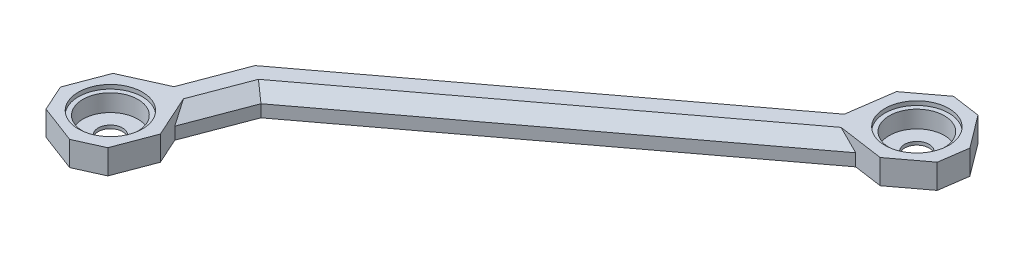
ISO-10303-21;
HEADER;
FILE_DESCRIPTION(('STEP AP214'),'2;1');
FILE_NAME('part.step','',(''),(''),'','','');
FILE_SCHEMA(('AUTOMOTIVE_DESIGN { 1 0 10303 214 1 1 1 1 }'));
ENDSEC;
DATA;
#1=APPLICATION_CONTEXT('core data for automotive mechanical design processes');
#2=APPLICATION_PROTOCOL_DEFINITION('international standard','automotive_design',2000,#1);
#3=PRODUCT_CONTEXT('',#1,'mechanical');
#4=PRODUCT('Part','Part','',(#3));
#5=PRODUCT_RELATED_PRODUCT_CATEGORY('part','',(#4));
#6=PRODUCT_DEFINITION_FORMATION('','',#4);
#7=PRODUCT_DEFINITION_CONTEXT('part definition',#1,'design');
#8=PRODUCT_DEFINITION('design','',#6,#7);
#9=PRODUCT_DEFINITION_SHAPE('','',#8);
#10=(LENGTH_UNIT() NAMED_UNIT(*) SI_UNIT(.MILLI.,.METRE.));
#11=(NAMED_UNIT(*) PLANE_ANGLE_UNIT() SI_UNIT($,.RADIAN.));
#12=(NAMED_UNIT(*) SI_UNIT($,.STERADIAN.) SOLID_ANGLE_UNIT());
#13=UNCERTAINTY_MEASURE_WITH_UNIT(LENGTH_MEASURE(1.E-05),#10,'distance_accuracy_value','');
#14=(GEOMETRIC_REPRESENTATION_CONTEXT(3) GLOBAL_UNCERTAINTY_ASSIGNED_CONTEXT((#13)) GLOBAL_UNIT_ASSIGNED_CONTEXT((#10,
#11,#12)) REPRESENTATION_CONTEXT('',''));
#15=CARTESIAN_POINT('',(0.,0.,0.));
#16=DIRECTION('',(0.,0.,1.));
#17=DIRECTION('',(1.,0.,0.));
#18=AXIS2_PLACEMENT_3D('',#15,#16,#17);
#19=CARTESIAN_POINT('',(129.479734703124,-540.705056381225,54.017746752288));
#20=DIRECTION('',(0.,1.,0.));
#21=DIRECTION('',(0.,0.,-1.));
#22=AXIS2_PLACEMENT_3D('',#19,#20,#21);
#23=CYLINDRICAL_SURFACE('',#22,6.75);
#24=CARTESIAN_POINT('',(129.479734703124,-540.705056381225,54.017746752288));
#25=DIRECTION('',(0.,-1.,0.));
#26=DIRECTION('',(0.,0.,-1.));
#27=AXIS2_PLACEMENT_3D('',#24,#25,#26);
#28=CIRCLE('',#27,6.75);
#29=CARTESIAN_POINT('',(129.479734703124,-540.705056381225,47.267746752288));
#30=VERTEX_POINT('',#29);
#31=EDGE_CURVE('E260',#30,#30,#28,.T.);
#32=ORIENTED_EDGE('',*,*,#31,.T.);
#33=EDGE_LOOP('',(#32));
#34=FACE_BOUND('',#33,.T.);
#35=CARTESIAN_POINT('',(129.479734703124,-536.505056381225,54.017746752288));
#36=DIRECTION('',(0.,-1.,0.));
#37=DIRECTION('',(0.,0.,-1.));
#38=AXIS2_PLACEMENT_3D('',#35,#36,#37);
#39=CIRCLE('',#38,6.75);
#40=CARTESIAN_POINT('',(129.479734703124,-536.505056381225,47.267746752288));
#41=VERTEX_POINT('',#40);
#42=EDGE_CURVE('E257',#41,#41,#39,.F.);
#43=ORIENTED_EDGE('',*,*,#42,.T.);
#44=EDGE_LOOP('',(#43));
#45=FACE_BOUND('',#44,.T.);
#46=ADVANCED_FACE('F41',(#34,#45),#23,.F.);
#47=CARTESIAN_POINT('',(27.0683923401905,-540.705056381225,149.47530428751));
#48=DIRECTION('',(0.,1.,0.));
#49=DIRECTION('',(0.,0.,-1.));
#50=AXIS2_PLACEMENT_3D('',#47,#48,#49);
#51=CYLINDRICAL_SURFACE('',#50,6.75);
#52=CARTESIAN_POINT('',(27.0683923401905,-540.705056381225,149.47530428751));
#53=DIRECTION('',(0.,-1.,0.));
#54=DIRECTION('',(0.,0.,-1.));
#55=AXIS2_PLACEMENT_3D('',#52,#53,#54);
#56=CIRCLE('',#55,6.75);
#57=CARTESIAN_POINT('',(27.0683923401905,-540.705056381225,142.72530428751));
#58=VERTEX_POINT('',#57);
#59=EDGE_CURVE('E212',#58,#58,#56,.T.);
#60=ORIENTED_EDGE('',*,*,#59,.T.);
#61=EDGE_LOOP('',(#60));
#62=FACE_BOUND('',#61,.T.);
#63=CARTESIAN_POINT('',(27.0683923401905,-536.505056381225,149.47530428751));
#64=DIRECTION('',(0.,-1.,0.));
#65=DIRECTION('',(0.,0.,-1.));
#66=AXIS2_PLACEMENT_3D('',#63,#64,#65);
#67=CIRCLE('',#66,6.75);
#68=CARTESIAN_POINT('',(27.0683923401905,-536.505056381225,142.72530428751));
#69=VERTEX_POINT('',#68);
#70=EDGE_CURVE('E254',#69,#69,#67,.F.);
#71=ORIENTED_EDGE('',*,*,#70,.T.);
#72=EDGE_LOOP('',(#71));
#73=FACE_BOUND('',#72,.T.);
#74=ADVANCED_FACE('F518',(#62,#73),#51,.F.);
#75=CARTESIAN_POINT('',(-49.6434018320776,-1083.01019668579,131.125269074854));
#76=DIRECTION('',(-0.354069498432484,0.,0.935219113512854));
#77=DIRECTION('',(0.935219113512854,0.,0.354069498432484));
#78=AXIS2_PLACEMENT_3D('',#75,#76,#77);
#79=PLANE('',#78);
#80=DIRECTION('',(0.,1.,0.));
#81=VECTOR('',#80,1.);
#82=CARTESIAN_POINT('',(28.2037928700447,-541.505098342895,160.59784591198));
#83=LINE('',#82,#81);
#84=CARTESIAN_POINT('',(28.2037928700447,-541.505098342895,160.59784591198));
#85=VERTEX_POINT('',#84);
#86=CARTESIAN_POINT('',(28.2037928700447,-535.505056381225,160.59784591198));
#87=VERTEX_POINT('',#86);
#88=EDGE_CURVE('E236',#85,#87,#83,.T.);
#89=ORIENTED_EDGE('',*,*,#88,.T.);
#90=DIRECTION('',(0.935219113512854,0.,0.354069498432484));
#91=VECTOR('',#90,1.);
#92=CARTESIAN_POINT('',(18.8516024500132,-535.505056381225,157.057151198387));
#93=LINE('',#92,#91);
#94=CARTESIAN_POINT('',(18.8516024500132,-535.505056381225,157.057151198387));
#95=VERTEX_POINT('',#94);
#96=EDGE_CURVE('E251',#95,#87,#93,.T.);
#97=ORIENTED_EDGE('',*,*,#96,.F.);
#98=DIRECTION('',(0.,-1.,0.));
#99=VECTOR('',#98,1.);
#100=CARTESIAN_POINT('',(18.8516024500132,-535.505056381225,157.057151198387));
#101=LINE('',#100,#99);
#102=CARTESIAN_POINT('',(18.8516024500132,-541.505098342895,157.057151198387));
#103=VERTEX_POINT('',#102);
#104=EDGE_CURVE('E242',#95,#103,#101,.T.);
#105=ORIENTED_EDGE('',*,*,#104,.T.);
#106=DIRECTION('',(0.935219113512854,0.,0.354069498432484));
#107=VECTOR('',#106,1.);
#108=CARTESIAN_POINT('',(28.2037928700447,-541.505098342895,160.59784591198));
#109=LINE('',#108,#107);
#110=EDGE_CURVE('E316',#103,#85,#109,.T.);
#111=ORIENTED_EDGE('',*,*,#110,.T.);
#112=EDGE_LOOP('',(#89,#97,#105,#111));
#113=FACE_BOUND('',#112,.T.);
#114=ADVANCED_FACE('F43',(#113),#79,.T.);
#115=CARTESIAN_POINT('',(-43.1708205184204,-1083.01019668579,19.4593086700157));
#116=DIRECTION('',(-0.911664969927574,0.,0.410934280155544));
#117=DIRECTION('',(0.410934280155544,0.,0.911664969927574));
#118=AXIS2_PLACEMENT_3D('',#115,#116,#117);
#119=PLANE('',#118);
#120=ORIENTED_EDGE('',*,*,#104,.F.);
#121=DIRECTION('',(0.410934280155544,0.,0.911664969927574));
#122=VECTOR('',#121,1.);
#123=CARTESIAN_POINT('',(15.9458555281162,-535.505056381225,150.610700249672));
#124=LINE('',#123,#122);
#125=CARTESIAN_POINT('',(15.9458555281162,-535.505056381225,150.610700249672));
#126=VERTEX_POINT('',#125);
#127=EDGE_CURVE('E103',#126,#95,#124,.T.);
#128=ORIENTED_EDGE('',*,*,#127,.F.);
#129=DIRECTION('',(0.,-1.,0.));
#130=VECTOR('',#129,1.);
#131=CARTESIAN_POINT('',(15.9458555281162,-535.505056381225,150.610700249672));
#132=LINE('',#131,#130);
#133=CARTESIAN_POINT('',(15.9458555281162,-541.505098342895,150.610700249672));
#134=VERTEX_POINT('',#133);
#135=EDGE_CURVE('E226',#126,#134,#132,.T.);
#136=ORIENTED_EDGE('',*,*,#135,.T.);
#137=DIRECTION('',(0.410934280155544,0.,0.911664969927574));
#138=VECTOR('',#137,1.);
#139=CARTESIAN_POINT('',(18.8516024500132,-541.505098342895,157.057151198387));
#140=LINE('',#139,#138);
#141=EDGE_CURVE('E314',#134,#103,#140,.T.);
#142=ORIENTED_EDGE('',*,*,#141,.T.);
#143=EDGE_LOOP('',(#120,#128,#136,#142));
#144=FACE_BOUND('',#143,.T.);
#145=ADVANCED_FACE('F497',(#144),#119,.T.);
#146=CARTESIAN_POINT('',(64.9283734286021,-1083.01019668579,144.044116871902));
#147=DIRECTION('',(0.410935769571844,0.,0.911664298569598));
#148=DIRECTION('',(0.911664298569598,0.,-0.410935769571844));
#149=AXIS2_PLACEMENT_3D('',#146,#147,#148);
#150=PLANE('',#149);
#151=DIRECTION('',(0.,1.,0.));
#152=VECTOR('',#151,1.);
#153=CARTESIAN_POINT('',(34.6502363681793,-541.505098342895,157.692089676857));
#154=LINE('',#153,#152);
#155=CARTESIAN_POINT('',(34.6502363681793,-541.505098342895,157.692089676857));
#156=VERTEX_POINT('',#155);
#157=CARTESIAN_POINT('',(34.6502363681793,-535.505056381225,157.692089676857));
#158=VERTEX_POINT('',#157);
#159=EDGE_CURVE('E437',#156,#158,#154,.T.);
#160=ORIENTED_EDGE('',*,*,#159,.T.);
#161=DIRECTION('',(0.911664298569598,0.,-0.410935769571843));
#162=VECTOR('',#161,1.);
#163=CARTESIAN_POINT('',(28.2037928700447,-535.505056381225,160.59784591198));
#164=LINE('',#163,#162);
#165=EDGE_CURVE('E99',#87,#158,#164,.T.);
#166=ORIENTED_EDGE('',*,*,#165,.F.);
#167=ORIENTED_EDGE('',*,*,#88,.F.);
#168=DIRECTION('',(0.911664298569598,0.,-0.410935769571844));
#169=VECTOR('',#168,1.);
#170=CARTESIAN_POINT('',(34.6502363681793,-541.505098342895,157.692089676857));
#171=LINE('',#170,#169);
#172=EDGE_CURVE('E319',#85,#156,#171,.T.);
#173=ORIENTED_EDGE('',*,*,#172,.T.);
#174=EDGE_LOOP('',(#160,#166,#167,#173));
#175=FACE_BOUND('',#174,.T.);
#176=ADVANCED_FACE('F501',(#175),#150,.T.);
#177=CARTESIAN_POINT('',(144.952876856489,-1083.01019668579,20.710121558638));
#178=DIRECTION('',(0.989947038457378,0.,0.141438541598343));
#179=DIRECTION('',(0.141438541598343,0.,-0.989947038457378));
#180=AXIS2_PLACEMENT_3D('',#177,#178,#179);
#181=PLANE('',#180);
#182=DIRECTION('',(0.,1.,0.));
#183=VECTOR('',#182,1.);
#184=CARTESIAN_POINT('',(140.479773283005,-541.505098342895,52.0179644227028));
#185=LINE('',#184,#183);
#186=CARTESIAN_POINT('',(140.479773283005,-541.505098342895,52.0179644227028));
#187=VERTEX_POINT('',#186);
#188=CARTESIAN_POINT('',(140.479773283005,-535.505056381225,52.0179644227028));
#189=VERTEX_POINT('',#188);
#190=EDGE_CURVE('E425',#187,#189,#185,.T.);
#191=ORIENTED_EDGE('',*,*,#190,.T.);
#192=DIRECTION('',(0.141438541598343,0.,-0.989947038457378));
#193=VECTOR('',#192,1.);
#194=CARTESIAN_POINT('',(139.479652047157,-535.505056381225,59.0179450809956));
#195=LINE('',#194,#193);
#196=CARTESIAN_POINT('',(139.479652047157,-535.505056381225,59.0179450809956));
#197=VERTEX_POINT('',#196);
#198=EDGE_CURVE('E228',#197,#189,#195,.T.);
#199=ORIENTED_EDGE('',*,*,#198,.F.);
#200=DIRECTION('',(0.,-1.,0.));
#201=VECTOR('',#200,1.);
#202=CARTESIAN_POINT('',(139.479652047157,-535.505056381225,59.0179450809956));
#203=LINE('',#202,#201);
#204=CARTESIAN_POINT('',(139.479652047157,-541.505098342895,59.0179450809956));
#205=VERTEX_POINT('',#204);
#206=EDGE_CURVE('E222',#197,#205,#203,.T.);
#207=ORIENTED_EDGE('',*,*,#206,.T.);
#208=DIRECTION('',(0.141438541598343,0.,-0.989947038457378));
#209=VECTOR('',#208,1.);
#210=CARTESIAN_POINT('',(140.479773283005,-541.505098342895,52.0179644227028));
#211=LINE('',#210,#209);
#212=EDGE_CURVE('E293',#205,#187,#211,.T.);
#213=ORIENTED_EDGE('',*,*,#212,.T.);
#214=EDGE_LOOP('',(#191,#199,#207,#213));
#215=FACE_BOUND('',#214,.T.);
#216=ADVANCED_FACE('F472',(#215),#181,.T.);
#217=CARTESIAN_POINT('',(63.8189360018059,-1083.01019668579,24.1615655712421));
#218=DIRECTION('',(-0.935219013507438,0.,-0.354069762581013));
#219=DIRECTION('',(-0.354069762581013,0.,0.935219013507438));
#220=AXIS2_PLACEMENT_3D('',#217,#218,#219);
#221=PLANE('',#220);
#222=ORIENTED_EDGE('',*,*,#135,.F.);
#223=DIRECTION('',(-0.354069762581013,0.,0.935219013507438));
#224=VECTOR('',#223,1.);
#225=CARTESIAN_POINT('',(19.4865539669991,-535.505056381225,141.258507966995));
#226=LINE('',#225,#224);
#227=CARTESIAN_POINT('',(19.4865539669991,-535.505056381225,141.258507966995));
#228=VERTEX_POINT('',#227);
#229=EDGE_CURVE('E204',#228,#126,#226,.T.);
#230=ORIENTED_EDGE('',*,*,#229,.F.);
#231=DIRECTION('',(0.,-1.,0.));
#232=VECTOR('',#231,1.);
#233=CARTESIAN_POINT('',(19.4865539669991,-535.505056381225,141.258507966995));
#234=LINE('',#233,#232);
#235=CARTESIAN_POINT('',(19.4865539669991,-541.505098342895,141.258507966995));
#236=VERTEX_POINT('',#235);
#237=EDGE_CURVE('E215',#228,#236,#234,.T.);
#238=ORIENTED_EDGE('',*,*,#237,.T.);
#239=DIRECTION('',(-0.354069762581013,0.,0.935219013507438));
#240=VECTOR('',#239,1.);
#241=CARTESIAN_POINT('',(15.9458555281162,-541.505098342895,150.610700249672));
#242=LINE('',#241,#240);
#243=EDGE_CURVE('E312',#236,#134,#242,.T.);
#244=ORIENTED_EDGE('',*,*,#243,.T.);
#245=EDGE_LOOP('',(#222,#230,#238,#244));
#246=FACE_BOUND('',#245,.T.);
#247=ADVANCED_FACE('F224',(#246),#221,.T.);
#248=CARTESIAN_POINT('',(82.52331484176,-1083.01019668579,31.242960281397));
#249=DIRECTION('',(0.935219013507438,0.,0.354069762581013));
#250=DIRECTION('',(0.354069762581013,0.,-0.935219013507438));
#251=AXIS2_PLACEMENT_3D('',#248,#249,#250);
#252=PLANE('',#251);
#253=DIRECTION('',(0.,-1.,0.));
#254=VECTOR('',#253,1.);
#255=CARTESIAN_POINT('',(38.1909348070621,-535.505056381225,148.33989739418));
#256=LINE('',#255,#254);
#257=CARTESIAN_POINT('',(38.1909348070621,-535.505056381225,148.33989739418));
#258=VERTEX_POINT('',#257);
#259=CARTESIAN_POINT('',(38.1909348070621,-541.505098342895,148.33989739418));
#260=VERTEX_POINT('',#259);
#261=EDGE_CURVE('E430',#258,#260,#256,.T.);
#262=ORIENTED_EDGE('',*,*,#261,.F.);
#263=DIRECTION('',(0.354069762581013,0.,-0.935219013507438));
#264=VECTOR('',#263,1.);
#265=CARTESIAN_POINT('',(34.6502363681793,-535.505056381225,157.692089676857));
#266=LINE('',#265,#264);
#267=EDGE_CURVE('E438',#158,#258,#266,.T.);
#268=ORIENTED_EDGE('',*,*,#267,.F.);
#269=ORIENTED_EDGE('',*,*,#159,.F.);
#270=DIRECTION('',(0.354069762581013,0.,-0.935219013507438));
#271=VECTOR('',#270,1.);
#272=CARTESIAN_POINT('',(38.1909348070621,-541.505098342895,148.33989739418));
#273=LINE('',#272,#271);
#274=EDGE_CURVE('E322',#156,#260,#273,.T.);
#275=ORIENTED_EDGE('',*,*,#274,.T.);
#276=EDGE_LOOP('',(#262,#268,#269,#275));
#277=FACE_BOUND('',#276,.T.);
#278=ADVANCED_FACE('F503',(#277),#252,.T.);
#279=CARTESIAN_POINT('',(64.9414713142655,-1083.01019668579,-48.7040395860676));
#280=DIRECTION('',(0.800012203893529,0.,-0.599983727797195));
#281=DIRECTION('',(-0.599983727797195,0.,-0.800012203893529));
#282=AXIS2_PLACEMENT_3D('',#279,#280,#281);
#283=PLANE('',#282);
#284=DIRECTION('',(0.,1.,0.));
#285=VECTOR('',#284,1.);
#286=CARTESIAN_POINT('',(134.479939937592,-541.505098342895,44.0178476274014));
#287=LINE('',#286,#285);
#288=CARTESIAN_POINT('',(134.479939937592,-541.505098342895,44.0178476274014));
#289=VERTEX_POINT('',#288);
#290=CARTESIAN_POINT('',(134.479939937592,-535.505056381225,44.0178476274014));
#291=VERTEX_POINT('',#290);
#292=EDGE_CURVE('E371',#289,#291,#287,.T.);
#293=ORIENTED_EDGE('',*,*,#292,.T.);
#294=DIRECTION('',(-0.599983727797195,0.,-0.800012203893529));
#295=VECTOR('',#294,1.);
#296=CARTESIAN_POINT('',(140.479773283005,-535.505056381225,52.0179644227028));
#297=LINE('',#296,#295);
#298=EDGE_CURVE('E426',#189,#291,#297,.T.);
#299=ORIENTED_EDGE('',*,*,#298,.F.);
#300=ORIENTED_EDGE('',*,*,#190,.F.);
#301=DIRECTION('',(-0.599983727797195,0.,-0.800012203893529));
#302=VECTOR('',#301,1.);
#303=CARTESIAN_POINT('',(134.479939937592,-541.505098342895,44.0178476274014));
#304=LINE('',#303,#302);
#305=EDGE_CURVE('E296',#187,#289,#304,.T.);
#306=ORIENTED_EDGE('',*,*,#305,.T.);
#307=EDGE_LOOP('',(#293,#299,#300,#306));
#308=FACE_BOUND('',#307,.T.);
#309=ADVANCED_FACE('F476',(#308),#283,.T.);
#310=CARTESIAN_POINT('',(78.5381950830812,-1083.01019668579,104.722079749864));
#311=DIRECTION('',(0.599983549015946,0.,0.800012337973753));
#312=DIRECTION('',(0.800012337973753,0.,-0.599983549015946));
#313=AXIS2_PLACEMENT_3D('',#310,#311,#312);
#314=PLANE('',#313);
#315=ORIENTED_EDGE('',*,*,#206,.F.);
#316=DIRECTION('',(0.800012337973753,0.,-0.599983549015946));
#317=VECTOR('',#316,1.);
#318=CARTESIAN_POINT('',(131.479516625404,-535.505056381225,65.0177896022797));
#319=LINE('',#318,#317);
#320=CARTESIAN_POINT('',(131.479516625404,-535.505056381225,65.0177896022797));
#321=VERTEX_POINT('',#320);
#322=EDGE_CURVE('E416',#321,#197,#319,.T.);
#323=ORIENTED_EDGE('',*,*,#322,.F.);
#324=DIRECTION('',(0.,1.,0.));
#325=VECTOR('',#324,1.);
#326=CARTESIAN_POINT('',(131.479516625404,-541.505098342895,65.0177896022797));
#327=LINE('',#326,#325);
#328=CARTESIAN_POINT('',(131.479516625404,-541.505098342895,65.0177896022797));
#329=VERTEX_POINT('',#328);
#330=EDGE_CURVE('E415',#329,#321,#327,.T.);
#331=ORIENTED_EDGE('',*,*,#330,.F.);
#332=DIRECTION('',(0.800012337973753,0.,-0.599983549015946));
#333=VECTOR('',#332,1.);
#334=CARTESIAN_POINT('',(139.479652047157,-541.505098342895,59.0179450809956));
#335=LINE('',#334,#333);
#336=EDGE_CURVE('E291',#329,#205,#335,.T.);
#337=ORIENTED_EDGE('',*,*,#336,.T.);
#338=EDGE_LOOP('',(#315,#323,#331,#337));
#339=FACE_BOUND('',#338,.T.);
#340=ADVANCED_FACE('F468',(#339),#314,.T.);
#341=CARTESIAN_POINT('',(-6.47342282222166,-1083.01019668579,45.3073530902757));
#342=DIRECTION('',(0.141441565607845,0.,-0.98994660639774));
#343=DIRECTION('',(-0.98994660639774,0.,-0.141441565607845));
#344=AXIS2_PLACEMENT_3D('',#341,#342,#343);
#345=PLANE('',#344);
#346=ORIENTED_EDGE('',*,*,#330,.T.);
#347=DIRECTION('',(0.989946622204622,0.,0.14144145497576));
#348=VECTOR('',#347,1.);
#349=CARTESIAN_POINT('',(120.279543101788,-535.505056381225,63.417561352253));
#350=LINE('',#349,#348);
#351=CARTESIAN_POINT('',(120.279543101788,-535.505056381225,63.417561352253));
#352=VERTEX_POINT('',#351);
#353=EDGE_CURVE('E419',#352,#321,#350,.T.);
#354=ORIENTED_EDGE('',*,*,#353,.F.);
#355=DIRECTION('',(0.808286247231902,-0.577352850059177,0.115486055713726));
#356=VECTOR('',#355,1.);
#357=CARTESIAN_POINT('',(120.279543101788,-535.505056381225,63.417561352253));
#358=LINE('',#357,#356);
#359=CARTESIAN_POINT('',(124.479533558646,-538.505075167305,64.0176477705298));
#360=VERTEX_POINT('',#359);
#361=EDGE_CURVE('E367',#352,#360,#358,.T.);
#362=ORIENTED_EDGE('',*,*,#361,.T.);
#363=DIRECTION('',(0.,1.,0.));
#364=VECTOR('',#363,1.);
#365=CARTESIAN_POINT('',(124.479532241821,-541.505098342895,64.0176460146904));
#366=LINE('',#365,#364);
#367=CARTESIAN_POINT('',(124.479532241821,-541.505098342895,64.0176460146904));
#368=VERTEX_POINT('',#367);
#369=EDGE_CURVE('E335',#368,#360,#366,.T.);
#370=ORIENTED_EDGE('',*,*,#369,.F.);
#371=DIRECTION('',(0.98994660639774,0.,0.141441565607845));
#372=VECTOR('',#371,1.);
#373=CARTESIAN_POINT('',(131.479516625404,-541.505098342895,65.0177896022797));
#374=LINE('',#373,#372);
#375=EDGE_CURVE('E333',#368,#329,#374,.T.);
#376=ORIENTED_EDGE('',*,*,#375,.T.);
#377=EDGE_LOOP('',(#346,#354,#362,#370,#376));
#378=FACE_BOUND('',#377,.T.);
#379=ADVANCED_FACE('F463',(#378),#345,.F.);
#380=CARTESIAN_POINT('',(-23.8316201354801,-1083.01019668579,10.7421683441062));
#381=DIRECTION('',(0.9116645153807,0.,-0.410935288574337));
#382=DIRECTION('',(-0.410935288574337,0.,-0.9116645153807));
#383=AXIS2_PLACEMENT_3D('',#380,#381,#382);
#384=PLANE('',#383);
#385=DIRECTION('',(-0.335526570667552,0.577354362423804,-0.74436809480678));
#386=VECTOR('',#385,1.);
#387=CARTESIAN_POINT('',(35.2851860225201,-538.50507736206,141.893461346626));
#388=LINE('',#387,#386);
#389=CARTESIAN_POINT('',(35.2851912753888,-538.505071745369,141.893463335336));
#390=VERTEX_POINT('',#389);
#391=CARTESIAN_POINT('',(33.5417389869689,-535.505056381225,138.025611639023));
#392=VERTEX_POINT('',#391);
#393=EDGE_CURVE('E399',#390,#392,#388,.T.);
#394=ORIENTED_EDGE('',*,*,#393,.T.);
#395=DIRECTION('',(-0.410935519115743,0.,-0.911664411463492));
#396=VECTOR('',#395,1.);
#397=CARTESIAN_POINT('',(38.1909348070621,-535.505056381225,148.33989739418));
#398=LINE('',#397,#396);
#399=EDGE_CURVE('E233',#258,#392,#398,.T.);
#400=ORIENTED_EDGE('',*,*,#399,.F.);
#401=ORIENTED_EDGE('',*,*,#261,.T.);
#402=DIRECTION('',(-0.410935288574337,0.,-0.9116645153807));
#403=VECTOR('',#402,1.);
#404=CARTESIAN_POINT('',(35.2851860225201,-541.505098342895,141.893461346626));
#405=LINE('',#404,#403);
#406=CARTESIAN_POINT('',(35.2851860225201,-541.505098342895,141.893461346626));
#407=VERTEX_POINT('',#406);
#408=EDGE_CURVE('E325',#260,#407,#405,.T.);
#409=ORIENTED_EDGE('',*,*,#408,.T.);
#410=DIRECTION('',(0.,1.,0.));
#411=VECTOR('',#410,1.);
#412=CARTESIAN_POINT('',(35.2851860225201,-541.505098342895,141.893461346626));
#413=LINE('',#412,#411);
#414=EDGE_CURVE('E341',#407,#390,#413,.T.);
#415=ORIENTED_EDGE('',*,*,#414,.T.);
#416=EDGE_LOOP('',(#394,#400,#401,#409,#415));
#417=FACE_BOUND('',#416,.T.);
#418=ADVANCED_FACE('F449',(#417),#384,.T.);
#419=CARTESIAN_POINT('',(-220.367994295224,-847.379551908985,-83.4303256463113));
#420=DIRECTION('',(-0.661302318628494,0.707104006773664,-0.250366065953852));
#421=DIRECTION('',(0.730365230114586,0.683056828265166,0.));
#422=AXIS2_PLACEMENT_3D('',#419,#420,#421);
#423=PLANE('',#422);
#424=DIRECTION('',(-0.354069696803158,0.,0.935219038410639));
#425=VECTOR('',#424,1.);
#426=CARTESIAN_POINT('',(35.2654047310352,-535.505056381225,122.175596654415));
#427=LINE('',#426,#425);
#428=CARTESIAN_POINT('',(35.2654047310352,-535.505056381225,122.175596654415));
#429=VERTEX_POINT('',#428);
#430=CARTESIAN_POINT('',(29.8008661066296,-535.505056381225,136.60932068657));
#431=VERTEX_POINT('',#430);
#432=EDGE_CURVE('E207',#429,#431,#427,.T.);
#433=ORIENTED_EDGE('',*,*,#432,.F.);
#434=DIRECTION('',(0.57653598835794,0.692649616680754,0.433408309380586));
#435=VECTOR('',#434,1.);
#436=CARTESIAN_POINT('',(32.7682979404926,-538.50507736206,120.298407971859));
#437=LINE('',#436,#435);
#438=CARTESIAN_POINT('',(32.7682979404926,-538.50507736206,120.298407971859));
#439=VERTEX_POINT('',#438);
#440=EDGE_CURVE('E379',#439,#429,#437,.T.);
#441=ORIENTED_EDGE('',*,*,#440,.F.);
#442=DIRECTION('',(0.354069785973779,0.,-0.93521900465104));
#443=VECTOR('',#442,1.);
#444=CARTESIAN_POINT('',(25.9329974651337,-538.50507736206,138.352766633034));
#445=LINE('',#444,#443);
#446=CARTESIAN_POINT('',(25.9329974651337,-538.50507736206,138.352766633034));
#447=VERTEX_POINT('',#446);
#448=EDGE_CURVE('E389',#447,#439,#445,.T.);
#449=ORIENTED_EDGE('',*,*,#448,.F.);
#450=DIRECTION('',(-0.744369354357326,-0.577352837040572,0.33552640112942));
#451=VECTOR('',#450,1.);
#452=CARTESIAN_POINT('',(29.8008639365435,-535.505056381225,136.609315872192));
#453=LINE('',#452,#451);
#454=EDGE_CURVE('E388',#431,#447,#453,.T.);
#455=ORIENTED_EDGE('',*,*,#454,.F.);
#456=EDGE_LOOP('',(#433,#441,#449,#455));
#457=FACE_BOUND('',#456,.T.);
#458=ADVANCED_FACE('F489',(#457),#423,.T.);
#459=CARTESIAN_POINT('',(-3.47299137580907,-1083.01019668579,24.3074856941509));
#460=DIRECTION('',(0.141441049312258,0.,-0.98994668016487));
#461=DIRECTION('',(-0.98994668016487,0.,-0.141441049312258));
#462=AXIS2_PLACEMENT_3D('',#459,#460,#461);
#463=PLANE('',#462);
#464=DIRECTION('',(0.,1.,0.));
#465=VECTOR('',#464,1.);
#466=CARTESIAN_POINT('',(127.479955554008,-541.505098342895,43.0177077651024));
#467=LINE('',#466,#465);
#468=CARTESIAN_POINT('',(127.479955554008,-541.505098342895,43.0177077651024));
#469=VERTEX_POINT('',#468);
#470=CARTESIAN_POINT('',(127.479955554008,-535.505056381225,43.0177077651024));
#471=VERTEX_POINT('',#470);
#472=EDGE_CURVE('E351',#469,#471,#467,.T.);
#473=ORIENTED_EDGE('',*,*,#472,.T.);
#474=DIRECTION('',(-0.98994668016487,0.,-0.141441049312258));
#475=VECTOR('',#474,1.);
#476=CARTESIAN_POINT('',(134.479939937592,-535.505056381225,44.0178476274014));
#477=LINE('',#476,#475);
#478=EDGE_CURVE('E372',#291,#471,#477,.T.);
#479=ORIENTED_EDGE('',*,*,#478,.F.);
#480=ORIENTED_EDGE('',*,*,#292,.F.);
#481=DIRECTION('',(-0.98994668016487,0.,-0.141441049312258));
#482=VECTOR('',#481,1.);
#483=CARTESIAN_POINT('',(127.479955554008,-541.505098342895,43.0177077651024));
#484=LINE('',#483,#482);
#485=EDGE_CURVE('E299',#289,#469,#484,.T.);
#486=ORIENTED_EDGE('',*,*,#485,.T.);
#487=EDGE_LOOP('',(#473,#479,#480,#486));
#488=FACE_BOUND('',#487,.T.);
#489=ADVANCED_FACE('F478',(#488),#463,.T.);
#490=CARTESIAN_POINT('',(-128.577661431331,-868.710099412362,-171.443993125453));
#491=DIRECTION('',(0.424254482814095,-0.707103986210737,0.565696107903378));
#492=DIRECTION('',(0.,0.624703746604736,0.780861850123315));
#493=AXIS2_PLACEMENT_3D('',#490,#491,#492);
#494=PLANE('',#493);
#495=DIRECTION('',(0.115486122636213,-0.577353184626739,-0.808285998690944));
#496=VECTOR('',#495,1.);
#497=CARTESIAN_POINT('',(117.87960678339,-535.505056381225,60.2175146341324));
#498=LINE('',#497,#496);
#499=CARTESIAN_POINT('',(117.87960678339,-535.505056381225,60.2175146341324));
#500=VERTEX_POINT('',#499);
#501=CARTESIAN_POINT('',(118.479691445827,-538.50507736206,56.017529219389));
#502=VERTEX_POINT('',#501);
#503=EDGE_CURVE('E358',#500,#502,#498,.T.);
#504=ORIENTED_EDGE('',*,*,#503,.T.);
#505=DIRECTION('',(-0.800011945789754,0.,0.599984071949991));
#506=VECTOR('',#505,1.);
#507=CARTESIAN_POINT('',(118.479691445827,-538.50507736206,56.017529219389));
#508=LINE('',#507,#506);
#509=EDGE_CURVE('E11',#502,#439,#508,.T.);
#510=ORIENTED_EDGE('',*,*,#509,.T.);
#511=ORIENTED_EDGE('',*,*,#440,.T.);
#512=DIRECTION('',(-0.80001194342984,0.,0.599984075096674));
#513=VECTOR('',#512,1.);
#514=CARTESIAN_POINT('',(117.87960678339,-535.505056381225,60.2175146341324));
#515=LINE('',#514,#513);
#516=EDGE_CURVE('E383',#500,#429,#515,.T.);
#517=ORIENTED_EDGE('',*,*,#516,.F.);
#518=EDGE_LOOP('',(#504,#510,#511,#517));
#519=FACE_BOUND('',#518,.T.);
#520=ADVANCED_FACE('F485',(#519),#494,.F.);
#521=CARTESIAN_POINT('',(66.5385995716973,-1083.01019668579,88.7218234524504));
#522=DIRECTION('',(-0.599984025837021,0.,-0.800011980373045));
#523=DIRECTION('',(-0.800011980373045,0.,0.599984025837021));
#524=AXIS2_PLACEMENT_3D('',#521,#522,#523);
#525=PLANE('',#524);
#526=DIRECTION('',(0.,-1.,0.));
#527=VECTOR('',#526,1.);
#528=CARTESIAN_POINT('',(119.479835033417,-535.505056381225,49.0175485610962));
#529=LINE('',#528,#527);
#530=CARTESIAN_POINT('',(119.479835033417,-535.505056381225,49.0175485610962));
#531=VERTEX_POINT('',#530);
#532=CARTESIAN_POINT('',(119.479835033417,-541.505098342895,49.0175485610962));
#533=VERTEX_POINT('',#532);
#534=EDGE_CURVE('E52',#531,#533,#529,.T.);
#535=ORIENTED_EDGE('',*,*,#534,.F.);
#536=DIRECTION('',(-0.800011980373045,0.,0.599984025837021));
#537=VECTOR('',#536,1.);
#538=CARTESIAN_POINT('',(127.479955554008,-535.505056381225,43.0177077651024));
#539=LINE('',#538,#537);
#540=EDGE_CURVE('E352',#471,#531,#539,.T.);
#541=ORIENTED_EDGE('',*,*,#540,.F.);
#542=ORIENTED_EDGE('',*,*,#472,.F.);
#543=DIRECTION('',(-0.800011980373045,0.,0.599984025837021));
#544=VECTOR('',#543,1.);
#545=CARTESIAN_POINT('',(119.479835033417,-541.505098342895,49.0175485610962));
#546=LINE('',#545,#544);
#547=EDGE_CURVE('E302',#469,#533,#546,.T.);
#548=ORIENTED_EDGE('',*,*,#547,.T.);
#549=EDGE_LOOP('',(#535,#541,#542,#548));
#550=FACE_BOUND('',#549,.T.);
#551=ADVANCED_FACE('F482',(#550),#525,.T.);
#552=CARTESIAN_POINT('',(123.952973780132,-1083.01019668579,17.7101592047906));
#553=DIRECTION('',(-0.989946595858015,0.,-0.141441639375142));
#554=DIRECTION('',(-0.141441639375142,0.,0.989946595858015));
#555=AXIS2_PLACEMENT_3D('',#552,#553,#554);
#556=PLANE('',#555);
#557=ORIENTED_EDGE('',*,*,#503,.F.);
#558=DIRECTION('',(-0.141441547184836,0.,0.989946609029982));
#559=VECTOR('',#558,1.);
#560=CARTESIAN_POINT('',(119.479835033417,-535.505056381225,49.0175485610962));
#561=LINE('',#560,#559);
#562=EDGE_CURVE('E61',#531,#500,#561,.T.);
#563=ORIENTED_EDGE('',*,*,#562,.F.);
#564=ORIENTED_EDGE('',*,*,#534,.T.);
#565=DIRECTION('',(-0.141441639375142,0.,0.989946595858015));
#566=VECTOR('',#565,1.);
#567=CARTESIAN_POINT('',(118.479691445827,-541.505098342895,56.017529219389));
#568=LINE('',#567,#566);
#569=CARTESIAN_POINT('',(118.479691445827,-541.505098342895,56.017529219389));
#570=VERTEX_POINT('',#569);
#571=EDGE_CURVE('E305',#533,#570,#568,.T.);
#572=ORIENTED_EDGE('',*,*,#571,.T.);
#573=DIRECTION('',(0.,1.,0.));
#574=VECTOR('',#573,1.);
#575=CARTESIAN_POINT('',(118.479691445827,-541.505098342895,56.017529219389));
#576=LINE('',#575,#574);
#577=EDGE_CURVE('E118',#570,#502,#576,.T.);
#578=ORIENTED_EDGE('',*,*,#577,.T.);
#579=EDGE_LOOP('',(#557,#563,#564,#572,#578));
#580=FACE_BOUND('',#579,.T.);
#581=ADVANCED_FACE('F483',(#580),#556,.T.);
#582=CARTESIAN_POINT('',(0.,-535.505056381225,0.));
#583=DIRECTION('',(0.,1.,0.));
#584=DIRECTION('',(0.,0.,-1.));
#585=AXIS2_PLACEMENT_3D('',#582,#583,#584);
#586=PLANE('',#585);
#587=CARTESIAN_POINT('',(27.0683923401905,-535.505056381225,149.47530428751));
#588=DIRECTION('',(0.,-1.,0.));
#589=DIRECTION('',(0.,0.,-1.));
#590=AXIS2_PLACEMENT_3D('',#587,#588,#589);
#591=CIRCLE('',#590,7.84999999999999);
#592=CARTESIAN_POINT('',(27.0683923401905,-535.505056381225,141.62530428751));
#593=VERTEX_POINT('',#592);
#594=EDGE_CURVE('E278',#593,#593,#591,.T.);
#595=ORIENTED_EDGE('',*,*,#594,.T.);
#596=EDGE_LOOP('',(#595));
#597=FACE_BOUND('',#596,.T.);
#598=CARTESIAN_POINT('',(129.479734703124,-535.505056381225,54.017746752288));
#599=DIRECTION('',(0.,-1.,0.));
#600=DIRECTION('',(0.,0.,-1.));
#601=AXIS2_PLACEMENT_3D('',#598,#599,#600);
#602=CIRCLE('',#601,7.84999999999999);
#603=CARTESIAN_POINT('',(129.479734703124,-535.505056381225,46.167746752288));
#604=VERTEX_POINT('',#603);
#605=EDGE_CURVE('E267',#604,#604,#602,.T.);
#606=ORIENTED_EDGE('',*,*,#605,.T.);
#607=EDGE_LOOP('',(#606));
#608=FACE_BOUND('',#607,.T.);
#609=DIRECTION('',(-0.911665088053401,0.,0.410934018091208));
#610=VECTOR('',#609,1.);
#611=CARTESIAN_POINT('',(29.8008661066296,-535.505056381225,136.60932068657));
#612=LINE('',#611,#610);
#613=EDGE_CURVE('E200',#431,#228,#612,.T.);
#614=ORIENTED_EDGE('',*,*,#613,.T.);
#615=ORIENTED_EDGE('',*,*,#229,.T.);
#616=ORIENTED_EDGE('',*,*,#127,.T.);
#617=ORIENTED_EDGE('',*,*,#96,.T.);
#618=ORIENTED_EDGE('',*,*,#165,.T.);
#619=ORIENTED_EDGE('',*,*,#267,.T.);
#620=ORIENTED_EDGE('',*,*,#399,.T.);
#621=DIRECTION('',(0.354069298900997,0.,-0.9352191890545));
#622=VECTOR('',#621,1.);
#623=CARTESIAN_POINT('',(33.541738986969,-535.505056381225,138.025611639023));
#624=LINE('',#623,#622);
#625=CARTESIAN_POINT('',(38.5948829352857,-535.505056381225,124.678514897823));
#626=VERTEX_POINT('',#625);
#627=EDGE_CURVE('E403',#392,#626,#624,.T.);
#628=ORIENTED_EDGE('',*,*,#627,.T.);
#629=DIRECTION('',(0.800011947996977,0.,-0.599984069006904));
#630=VECTOR('',#629,1.);
#631=CARTESIAN_POINT('',(38.5948829352856,-535.505056381225,124.678514897823));
#632=LINE('',#631,#630);
#633=EDGE_CURVE('E221',#626,#352,#632,.T.);
#634=ORIENTED_EDGE('',*,*,#633,.T.);
#635=ORIENTED_EDGE('',*,*,#353,.T.);
#636=ORIENTED_EDGE('',*,*,#322,.T.);
#637=ORIENTED_EDGE('',*,*,#198,.T.);
#638=ORIENTED_EDGE('',*,*,#298,.T.);
#639=ORIENTED_EDGE('',*,*,#478,.T.);
#640=ORIENTED_EDGE('',*,*,#540,.T.);
#641=ORIENTED_EDGE('',*,*,#562,.T.);
#642=ORIENTED_EDGE('',*,*,#516,.T.);
#643=ORIENTED_EDGE('',*,*,#432,.T.);
#644=EDGE_LOOP('',(#614,#615,#616,#617,#618,#619,#620,#628,#634,#635,#636,#637,#638,#639,#640,
#641,#642,#643));
#645=FACE_BOUND('',#644,.T.);
#646=ADVANCED_FACE('F202',(#597,#608,#645),#586,.T.);
#647=CARTESIAN_POINT('',(32.7682979404926,-541.505098342895,120.298407971859));
#648=DIRECTION('',(0.599984071949991,0.,0.800011945789754));
#649=DIRECTION('',(0.800011945789754,0.,-0.599984071949991));
#650=AXIS2_PLACEMENT_3D('',#647,#648,#649);
#651=PLANE('',#650);
#652=ORIENTED_EDGE('',*,*,#509,.F.);
#653=ORIENTED_EDGE('',*,*,#577,.F.);
#654=DIRECTION('',(-0.800011945789754,0.,0.599984071949991));
#655=VECTOR('',#654,1.);
#656=CARTESIAN_POINT('',(32.7682979404926,-541.505098342895,120.298407971859));
#657=LINE('',#656,#655);
#658=CARTESIAN_POINT('',(32.7682979404926,-541.505098342895,120.298407971859));
#659=VERTEX_POINT('',#658);
#660=EDGE_CURVE('E307',#570,#659,#657,.T.);
#661=ORIENTED_EDGE('',*,*,#660,.T.);
#662=DIRECTION('',(0.,1.,0.));
#663=VECTOR('',#662,1.);
#664=CARTESIAN_POINT('',(32.7682979404926,-541.505098342895,120.298407971859));
#665=LINE('',#664,#663);
#666=EDGE_CURVE('E111',#659,#439,#665,.T.);
#667=ORIENTED_EDGE('',*,*,#666,.T.);
#668=EDGE_LOOP('',(#652,#653,#661,#667));
#669=FACE_BOUND('',#668,.T.);
#670=ADVANCED_FACE('F656',(#669),#651,.F.);
#671=CARTESIAN_POINT('',(25.9329974651337,-541.505098342895,138.352766633034));
#672=DIRECTION('',(0.93521900465104,0.,0.354069785973779));
#673=DIRECTION('',(0.354069785973779,0.,-0.93521900465104));
#674=AXIS2_PLACEMENT_3D('',#671,#672,#673);
#675=PLANE('',#674);
#676=ORIENTED_EDGE('',*,*,#448,.T.);
#677=ORIENTED_EDGE('',*,*,#666,.F.);
#678=DIRECTION('',(-0.354069785973779,0.,0.93521900465104));
#679=VECTOR('',#678,1.);
#680=CARTESIAN_POINT('',(25.9329974651337,-541.505098342895,138.352766633034));
#681=LINE('',#680,#679);
#682=CARTESIAN_POINT('',(25.9329974651337,-541.505098342895,138.352766633034));
#683=VERTEX_POINT('',#682);
#684=EDGE_CURVE('E309',#659,#683,#681,.T.);
#685=ORIENTED_EDGE('',*,*,#684,.T.);
#686=DIRECTION('',(0.,1.,0.));
#687=VECTOR('',#686,1.);
#688=CARTESIAN_POINT('',(25.9329974651337,-541.505098342895,138.352766633034));
#689=LINE('',#688,#687);
#690=EDGE_CURVE('E344',#683,#447,#689,.T.);
#691=ORIENTED_EDGE('',*,*,#690,.T.);
#692=EDGE_LOOP('',(#676,#677,#685,#691));
#693=FACE_BOUND('',#692,.T.);
#694=ADVANCED_FACE('F491',(#693),#675,.F.);
#695=CARTESIAN_POINT('',(41.0919934511185,-541.505098342895,126.55571103096));
#696=DIRECTION('',(-0.935218946532656,0.,-0.354069939484206));
#697=DIRECTION('',(-0.354069939484206,0.,0.935218946532656));
#698=AXIS2_PLACEMENT_3D('',#695,#696,#697);
#699=PLANE('',#698);
#700=DIRECTION('',(0.354069939484206,0.,-0.935218946532656));
#701=VECTOR('',#700,1.);
#702=CARTESIAN_POINT('',(35.2851860225201,-538.50507736206,141.893461346626));
#703=LINE('',#702,#701);
#704=CARTESIAN_POINT('',(41.0919934511184,-538.50507736206,126.55571103096));
#705=VERTEX_POINT('',#704);
#706=EDGE_CURVE('E393',#390,#705,#703,.T.);
#707=ORIENTED_EDGE('',*,*,#706,.F.);
#708=ORIENTED_EDGE('',*,*,#414,.F.);
#709=DIRECTION('',(0.354069939484206,0.,-0.935218946532656));
#710=VECTOR('',#709,1.);
#711=CARTESIAN_POINT('',(41.0919934511185,-541.505098342895,126.55571103096));
#712=LINE('',#711,#710);
#713=CARTESIAN_POINT('',(41.0919934511185,-541.505098342895,126.55571103096));
#714=VERTEX_POINT('',#713);
#715=EDGE_CURVE('E328',#407,#714,#712,.T.);
#716=ORIENTED_EDGE('',*,*,#715,.T.);
#717=DIRECTION('',(0.,1.,0.));
#718=VECTOR('',#717,1.);
#719=CARTESIAN_POINT('',(41.0919934511185,-541.505098342895,126.55571103096));
#720=LINE('',#719,#718);
#721=EDGE_CURVE('E338',#714,#705,#720,.T.);
#722=ORIENTED_EDGE('',*,*,#721,.T.);
#723=EDGE_LOOP('',(#707,#708,#716,#722));
#724=FACE_BOUND('',#723,.T.);
#725=ADVANCED_FACE('F506',(#724),#699,.F.);
#726=CARTESIAN_POINT('',(124.479532241821,-541.505098342895,64.0176460146904));
#727=DIRECTION('',(-0.599984102697436,0.,-0.800011922730125));
#728=DIRECTION('',(-0.800011922730125,0.,0.599984102697436));
#729=AXIS2_PLACEMENT_3D('',#726,#727,#728);
#730=PLANE('',#729);
#731=DIRECTION('',(0.800011922730125,0.,-0.599984102697436));
#732=VECTOR('',#731,1.);
#733=CARTESIAN_POINT('',(41.0919934511185,-538.50507736206,126.55571103096));
#734=LINE('',#733,#732);
#735=EDGE_CURVE('E362',#705,#360,#734,.T.);
#736=ORIENTED_EDGE('',*,*,#735,.F.);
#737=ORIENTED_EDGE('',*,*,#721,.F.);
#738=DIRECTION('',(0.800011922730125,0.,-0.599984102697436));
#739=VECTOR('',#738,1.);
#740=CARTESIAN_POINT('',(124.479532241821,-541.505098342895,64.0176460146904));
#741=LINE('',#740,#739);
#742=EDGE_CURVE('E331',#714,#368,#741,.T.);
#743=ORIENTED_EDGE('',*,*,#742,.T.);
#744=ORIENTED_EDGE('',*,*,#369,.T.);
#745=EDGE_LOOP('',(#736,#737,#743,#744));
#746=FACE_BOUND('',#745,.T.);
#747=ADVANCED_FACE('F508',(#746),#730,.F.);
#748=CARTESIAN_POINT('',(0.,-541.505098342895,0.));
#749=DIRECTION('',(0.,-1.,0.));
#750=DIRECTION('',(0.,0.,1.));
#751=AXIS2_PLACEMENT_3D('',#748,#749,#750);
#752=PLANE('',#751);
#753=CARTESIAN_POINT('',(27.0683923401905,-541.505098342895,149.47530428751));
#754=DIRECTION('',(0.,1.,0.));
#755=DIRECTION('',(0.,0.,1.));
#756=AXIS2_PLACEMENT_3D('',#753,#754,#755);
#757=CIRCLE('',#756,3.);
#758=CARTESIAN_POINT('',(27.0683923401905,-541.505098342895,152.47530428751));
#759=VERTEX_POINT('',#758);
#760=EDGE_CURVE('E263',#759,#759,#757,.T.);
#761=ORIENTED_EDGE('',*,*,#760,.T.);
#762=EDGE_LOOP('',(#761));
#763=FACE_BOUND('',#762,.T.);
#764=CARTESIAN_POINT('',(129.479734703124,-541.505098342895,54.017746752288));
#765=DIRECTION('',(0.,1.,0.));
#766=DIRECTION('',(0.,0.,1.));
#767=AXIS2_PLACEMENT_3D('',#764,#765,#766);
#768=CIRCLE('',#767,2.99999999999999);
#769=CARTESIAN_POINT('',(129.479734703124,-541.505098342895,57.017746752288));
#770=VERTEX_POINT('',#769);
#771=EDGE_CURVE('E269',#770,#770,#768,.T.);
#772=ORIENTED_EDGE('',*,*,#771,.T.);
#773=EDGE_LOOP('',(#772));
#774=FACE_BOUND('',#773,.T.);
#775=ORIENTED_EDGE('',*,*,#684,.F.);
#776=ORIENTED_EDGE('',*,*,#660,.F.);
#777=ORIENTED_EDGE('',*,*,#571,.F.);
#778=ORIENTED_EDGE('',*,*,#547,.F.);
#779=ORIENTED_EDGE('',*,*,#485,.F.);
#780=ORIENTED_EDGE('',*,*,#305,.F.);
#781=ORIENTED_EDGE('',*,*,#212,.F.);
#782=ORIENTED_EDGE('',*,*,#336,.F.);
#783=ORIENTED_EDGE('',*,*,#375,.F.);
#784=ORIENTED_EDGE('',*,*,#742,.F.);
#785=ORIENTED_EDGE('',*,*,#715,.F.);
#786=ORIENTED_EDGE('',*,*,#408,.F.);
#787=ORIENTED_EDGE('',*,*,#274,.F.);
#788=ORIENTED_EDGE('',*,*,#172,.F.);
#789=ORIENTED_EDGE('',*,*,#110,.F.);
#790=ORIENTED_EDGE('',*,*,#141,.F.);
#791=ORIENTED_EDGE('',*,*,#243,.F.);
#792=DIRECTION('',(0.9116650880534,0.,-0.410934018091209));
#793=VECTOR('',#792,1.);
#794=CARTESIAN_POINT('',(19.4865539669991,-541.505098342895,141.258507966995));
#795=LINE('',#794,#793);
#796=EDGE_CURVE('E211',#236,#683,#795,.T.);
#797=ORIENTED_EDGE('',*,*,#796,.T.);
#798=EDGE_LOOP('',(#775,#776,#777,#778,#779,#780,#781,#782,#783,#784,#785,#786,#787,#788,#789,
#790,#791,#797));
#799=FACE_BOUND('',#798,.T.);
#800=ADVANCED_FACE('F493',(#763,#774,#799),#752,.T.);
#801=CARTESIAN_POINT('',(201.116572709247,-747.808697775241,268.166555445239));
#802=DIRECTION('',(-0.424253872735841,-0.70710499957282,-0.565695298767599));
#803=DIRECTION('',(0.,-0.624702655886392,0.780862722716668));
#804=AXIS2_PLACEMENT_3D('',#801,#802,#803);
#805=PLANE('',#804);
#806=DIRECTION('',(0.576536132729623,-0.692648756805788,0.43340949153493));
#807=VECTOR('',#806,1.);
#808=CARTESIAN_POINT('',(38.5948829352856,-535.505056381225,124.678514897823));
#809=LINE('',#808,#807);
#810=EDGE_CURVE('E404',#626,#705,#809,.T.);
#811=ORIENTED_EDGE('',*,*,#810,.T.);
#812=ORIENTED_EDGE('',*,*,#735,.T.);
#813=ORIENTED_EDGE('',*,*,#361,.F.);
#814=ORIENTED_EDGE('',*,*,#633,.F.);
#815=EDGE_LOOP('',(#811,#812,#813,#814));
#816=FACE_BOUND('',#815,.T.);
#817=ADVANCED_FACE('F457',(#816),#805,.F.);
#818=CARTESIAN_POINT('',(293.539643650332,-769.139495184975,111.132638255638));
#819=DIRECTION('',(-0.661301791272194,-0.707104684563838,-0.2503655446104));
#820=DIRECTION('',(-0.730365828494173,0.683056188441347,0.));
#821=AXIS2_PLACEMENT_3D('',#818,#819,#820);
#822=PLANE('',#821);
#823=ORIENTED_EDGE('',*,*,#706,.T.);
#824=ORIENTED_EDGE('',*,*,#810,.F.);
#825=ORIENTED_EDGE('',*,*,#627,.F.);
#826=ORIENTED_EDGE('',*,*,#393,.F.);
#827=EDGE_LOOP('',(#823,#824,#825,#826));
#828=FACE_BOUND('',#827,.T.);
#829=ADVANCED_FACE('F452',(#828),#822,.F.);
#830=CARTESIAN_POINT('',(56.2108991855948,-1083.01019668579,124.704969896705));
#831=DIRECTION('',(0.410934018091206,0.,0.911665088053401));
#832=DIRECTION('',(0.911665088053402,0.,-0.410934018091206));
#833=AXIS2_PLACEMENT_3D('',#830,#831,#832);
#834=PLANE('',#833);
#835=ORIENTED_EDGE('',*,*,#454,.T.);
#836=ORIENTED_EDGE('',*,*,#690,.F.);
#837=ORIENTED_EDGE('',*,*,#796,.F.);
#838=ORIENTED_EDGE('',*,*,#237,.F.);
#839=ORIENTED_EDGE('',*,*,#613,.F.);
#840=EDGE_LOOP('',(#835,#836,#837,#838,#839));
#841=FACE_BOUND('',#840,.T.);
#842=ADVANCED_FACE('F216',(#841),#834,.F.);
#843=CARTESIAN_POINT('',(129.479734703124,-540.705056381225,54.017746752288));
#844=DIRECTION('',(0.,1.,0.));
#845=DIRECTION('',(0.,0.,-1.));
#846=AXIS2_PLACEMENT_3D('',#843,#844,#845);
#847=PLANE('',#846);
#848=CARTESIAN_POINT('',(129.479734703124,-540.705056381225,54.017746752288));
#849=DIRECTION('',(0.,-1.,0.));
#850=DIRECTION('',(0.,0.,-1.));
#851=AXIS2_PLACEMENT_3D('',#848,#849,#850);
#852=CIRCLE('',#851,2.99999999999999);
#853=CARTESIAN_POINT('',(129.479734703124,-540.705056381225,51.017746752288));
#854=VERTEX_POINT('',#853);
#855=EDGE_CURVE('E45',#854,#854,#852,.T.);
#856=ORIENTED_EDGE('',*,*,#855,.T.);
#857=EDGE_LOOP('',(#856));
#858=FACE_BOUND('',#857,.T.);
#859=ORIENTED_EDGE('',*,*,#31,.F.);
#860=EDGE_LOOP('',(#859));
#861=FACE_BOUND('',#860,.T.);
#862=ADVANCED_FACE('F529',(#858,#861),#847,.T.);
#863=CARTESIAN_POINT('',(27.0683923401905,-540.705056381225,149.47530428751));
#864=DIRECTION('',(0.,1.,0.));
#865=DIRECTION('',(0.,0.,-1.));
#866=AXIS2_PLACEMENT_3D('',#863,#864,#865);
#867=PLANE('',#866);
#868=CARTESIAN_POINT('',(27.0683923401905,-540.705056381225,149.47530428751));
#869=DIRECTION('',(0.,-1.,0.));
#870=DIRECTION('',(0.,0.,-1.));
#871=AXIS2_PLACEMENT_3D('',#868,#869,#870);
#872=CIRCLE('',#871,3.);
#873=CARTESIAN_POINT('',(27.0683923401905,-540.705056381225,146.47530428751));
#874=VERTEX_POINT('',#873);
#875=EDGE_CURVE('E261',#874,#874,#872,.T.);
#876=ORIENTED_EDGE('',*,*,#875,.T.);
#877=EDGE_LOOP('',(#876));
#878=FACE_BOUND('',#877,.T.);
#879=ORIENTED_EDGE('',*,*,#59,.F.);
#880=EDGE_LOOP('',(#879));
#881=FACE_BOUND('',#880,.T.);
#882=ADVANCED_FACE('F553',(#878,#881),#867,.T.);
#883=CARTESIAN_POINT('',(27.0683923401905,-536.505056381225,149.47530428751));
#884=DIRECTION('',(0.,1.,0.));
#885=DIRECTION('',(0.,0.,-1.));
#886=AXIS2_PLACEMENT_3D('',#883,#884,#885);
#887=PLANE('',#886);
#888=CARTESIAN_POINT('',(27.0683923401905,-536.505056381225,149.47530428751));
#889=DIRECTION('',(0.,-1.,0.));
#890=DIRECTION('',(0.,0.,-1.));
#891=AXIS2_PLACEMENT_3D('',#888,#889,#890);
#892=CIRCLE('',#891,7.84999999999999);
#893=CARTESIAN_POINT('',(27.0683923401905,-536.505056381225,141.62530428751));
#894=VERTEX_POINT('',#893);
#895=EDGE_CURVE('E258',#894,#894,#892,.T.);
#896=ORIENTED_EDGE('',*,*,#895,.F.);
#897=EDGE_LOOP('',(#896));
#898=FACE_BOUND('',#897,.T.);
#899=ORIENTED_EDGE('',*,*,#70,.F.);
#900=EDGE_LOOP('',(#899));
#901=FACE_BOUND('',#900,.T.);
#902=ADVANCED_FACE('F560',(#898,#901),#887,.T.);
#903=CARTESIAN_POINT('',(27.0683923401905,-536.505056381225,149.47530428751));
#904=DIRECTION('',(0.,1.,0.));
#905=DIRECTION('',(0.,0.,-1.));
#906=AXIS2_PLACEMENT_3D('',#903,#904,#905);
#907=CYLINDRICAL_SURFACE('',#906,7.84999999999999);
#908=ORIENTED_EDGE('',*,*,#895,.T.);
#909=EDGE_LOOP('',(#908));
#910=FACE_BOUND('',#909,.T.);
#911=ORIENTED_EDGE('',*,*,#594,.F.);
#912=EDGE_LOOP('',(#911));
#913=FACE_BOUND('',#912,.T.);
#914=ADVANCED_FACE('F567',(#910,#913),#907,.F.);
#915=CARTESIAN_POINT('',(129.479734703124,-536.505056381225,54.017746752288));
#916=DIRECTION('',(0.,1.,0.));
#917=DIRECTION('',(0.,0.,-1.));
#918=AXIS2_PLACEMENT_3D('',#915,#916,#917);
#919=PLANE('',#918);
#920=CARTESIAN_POINT('',(129.479734703124,-536.505056381225,54.017746752288));
#921=DIRECTION('',(0.,-1.,0.));
#922=DIRECTION('',(0.,0.,-1.));
#923=AXIS2_PLACEMENT_3D('',#920,#921,#922);
#924=CIRCLE('',#923,7.84999999999999);
#925=CARTESIAN_POINT('',(129.479734703124,-536.505056381225,46.167746752288));
#926=VERTEX_POINT('',#925);
#927=EDGE_CURVE('E281',#926,#926,#924,.T.);
#928=ORIENTED_EDGE('',*,*,#927,.F.);
#929=EDGE_LOOP('',(#928));
#930=FACE_BOUND('',#929,.T.);
#931=ORIENTED_EDGE('',*,*,#42,.F.);
#932=EDGE_LOOP('',(#931));
#933=FACE_BOUND('',#932,.T.);
#934=ADVANCED_FACE('F575',(#930,#933),#919,.T.);
#935=CARTESIAN_POINT('',(129.479734703124,-536.505056381225,54.017746752288));
#936=DIRECTION('',(0.,1.,0.));
#937=DIRECTION('',(0.,0.,-1.));
#938=AXIS2_PLACEMENT_3D('',#935,#936,#937);
#939=CYLINDRICAL_SURFACE('',#938,7.84999999999999);
#940=ORIENTED_EDGE('',*,*,#927,.T.);
#941=EDGE_LOOP('',(#940));
#942=FACE_BOUND('',#941,.T.);
#943=ORIENTED_EDGE('',*,*,#605,.F.);
#944=EDGE_LOOP('',(#943));
#945=FACE_BOUND('',#944,.T.);
#946=ADVANCED_FACE('F583',(#942,#945),#939,.F.);
#947=CARTESIAN_POINT('',(27.0683923401905,-535.505056381225,149.47530428751));
#948=DIRECTION('',(0.,-1.,0.));
#949=DIRECTION('',(0.,0.,1.));
#950=AXIS2_PLACEMENT_3D('',#947,#948,#949);
#951=CYLINDRICAL_SURFACE('',#950,3.);
#952=ORIENTED_EDGE('',*,*,#875,.F.);
#953=EDGE_LOOP('',(#952));
#954=FACE_BOUND('',#953,.T.);
#955=ORIENTED_EDGE('',*,*,#760,.F.);
#956=EDGE_LOOP('',(#955));
#957=FACE_BOUND('',#956,.T.);
#958=ADVANCED_FACE('F591',(#954,#957),#951,.F.);
#959=CARTESIAN_POINT('',(129.479734703124,-535.505056381225,54.017746752288));
#960=DIRECTION('',(0.,-1.,0.));
#961=DIRECTION('',(0.,0.,1.));
#962=AXIS2_PLACEMENT_3D('',#959,#960,#961);
#963=CYLINDRICAL_SURFACE('',#962,2.99999999999999);
#964=ORIENTED_EDGE('',*,*,#855,.F.);
#965=EDGE_LOOP('',(#964));
#966=FACE_BOUND('',#965,.T.);
#967=ORIENTED_EDGE('',*,*,#771,.F.);
#968=EDGE_LOOP('',(#967));
#969=FACE_BOUND('',#968,.T.);
#970=ADVANCED_FACE('F599',(#966,#969),#963,.F.);
#971=CLOSED_SHELL('',(#46,#74,#114,#145,#176,#216,#247,#278,#309,#340,#379,#418,#458,#489,#520,
#551,#581,#646,#670,#694,#725,#747,#800,#817,#829,#842,#862,#882,#902,#914,#934,#946,#958,#970));
#972=MANIFOLD_SOLID_BREP('B2',#971);
#973=ADVANCED_BREP_SHAPE_REPRESENTATION('',(#18,#972),#14);
#974=SHAPE_DEFINITION_REPRESENTATION(#9,#973);
ENDSEC;
END-ISO-10303-21;
